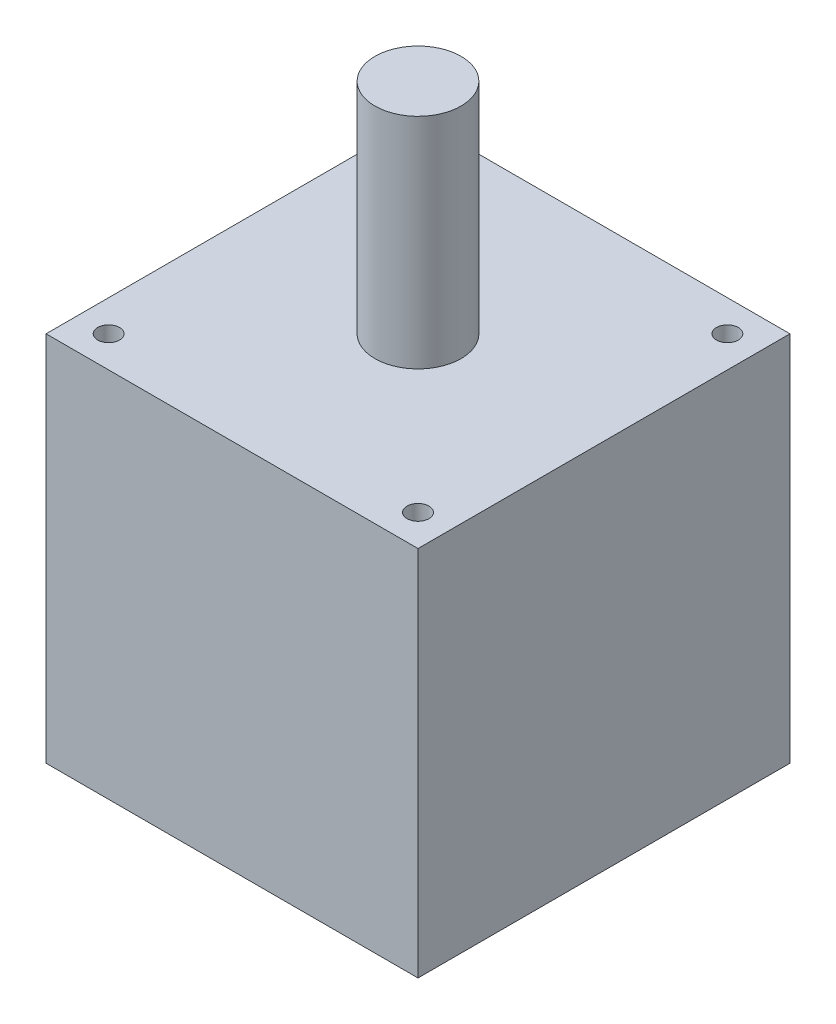
ISO-10303-21;
HEADER;
FILE_DESCRIPTION(('STEP AP214'),'2;1');
FILE_NAME('part.step','',(''),(''),'','','');
FILE_SCHEMA(('AUTOMOTIVE_DESIGN { 1 0 10303 214 1 1 1 1 }'));
ENDSEC;
DATA;
#1=APPLICATION_CONTEXT('core data for automotive mechanical design processes');
#2=APPLICATION_PROTOCOL_DEFINITION('international standard','automotive_design',2000,#1);
#3=PRODUCT_CONTEXT('',#1,'mechanical');
#4=PRODUCT('Part','Part','',(#3));
#5=PRODUCT_RELATED_PRODUCT_CATEGORY('part','',(#4));
#6=PRODUCT_DEFINITION_FORMATION('','',#4);
#7=PRODUCT_DEFINITION_CONTEXT('part definition',#1,'design');
#8=PRODUCT_DEFINITION('design','',#6,#7);
#9=PRODUCT_DEFINITION_SHAPE('','',#8);
#10=(LENGTH_UNIT() NAMED_UNIT(*) SI_UNIT(.MILLI.,.METRE.));
#11=(NAMED_UNIT(*) PLANE_ANGLE_UNIT() SI_UNIT($,.RADIAN.));
#12=(NAMED_UNIT(*) SI_UNIT($,.STERADIAN.) SOLID_ANGLE_UNIT());
#13=UNCERTAINTY_MEASURE_WITH_UNIT(LENGTH_MEASURE(1.E-05),#10,'distance_accuracy_value','');
#14=(GEOMETRIC_REPRESENTATION_CONTEXT(3) GLOBAL_UNCERTAINTY_ASSIGNED_CONTEXT((#13)) GLOBAL_UNIT_ASSIGNED_CONTEXT((#10,
#11,#12)) REPRESENTATION_CONTEXT('',''));
#15=CARTESIAN_POINT('',(0.,0.,0.));
#16=DIRECTION('',(0.,0.,1.));
#17=DIRECTION('',(1.,0.,0.));
#18=AXIS2_PLACEMENT_3D('',#15,#16,#17);
#19=CARTESIAN_POINT('',(17.9550877578617,-3.59210244842767,17.9550877578617));
#20=DIRECTION('',(0.,1.,0.));
#21=DIRECTION('',(0.,0.,1.));
#22=AXIS2_PLACEMENT_3D('',#19,#20,#21);
#23=CYLINDRICAL_SURFACE('',#22,1.27);
#24=CARTESIAN_POINT('',(17.9550877578617,43.18,17.9550877578617));
#25=DIRECTION('',(0.,1.,0.));
#26=DIRECTION('',(0.,0.,1.));
#27=AXIS2_PLACEMENT_3D('',#24,#25,#26);
#28=CIRCLE('',#27,1.27);
#29=CARTESIAN_POINT('',(17.9550877578617,43.18,19.2250877578617));
#30=VERTEX_POINT('',#29);
#31=EDGE_CURVE('E48',#30,#30,#28,.T.);
#32=ORIENTED_EDGE('',*,*,#31,.T.);
#33=EDGE_LOOP('',(#32));
#34=FACE_BOUND('',#33,.T.);
#35=CARTESIAN_POINT('',(17.9550877578617,0.,17.9550877578617));
#36=DIRECTION('',(0.,-1.,0.));
#37=DIRECTION('',(0.,0.,-1.));
#38=AXIS2_PLACEMENT_3D('',#35,#36,#37);
#39=CIRCLE('',#38,1.27);
#40=CARTESIAN_POINT('',(17.9550877578617,0.,16.6850877578617));
#41=VERTEX_POINT('',#40);
#42=EDGE_CURVE('E11',#41,#41,#39,.F.);
#43=ORIENTED_EDGE('',*,*,#42,.F.);
#44=EDGE_LOOP('',(#43));
#45=FACE_BOUND('',#44,.T.);
#46=ADVANCED_FACE('F39',(#34,#45),#23,.F.);
#47=CARTESIAN_POINT('',(-17.9605122421383,-3.59210244842767,17.9550877578617));
#48=DIRECTION('',(0.,1.,0.));
#49=DIRECTION('',(0.,0.,1.));
#50=AXIS2_PLACEMENT_3D('',#47,#48,#49);
#51=CYLINDRICAL_SURFACE('',#50,1.27);
#52=CARTESIAN_POINT('',(-17.9605122421383,43.18,17.9550877578617));
#53=DIRECTION('',(0.,1.,0.));
#54=DIRECTION('',(0.,0.,1.));
#55=AXIS2_PLACEMENT_3D('',#52,#53,#54);
#56=CIRCLE('',#55,1.27);
#57=CARTESIAN_POINT('',(-17.9605122421383,43.18,19.2250877578617));
#58=VERTEX_POINT('',#57);
#59=EDGE_CURVE('E130',#58,#58,#56,.T.);
#60=ORIENTED_EDGE('',*,*,#59,.T.);
#61=EDGE_LOOP('',(#60));
#62=FACE_BOUND('',#61,.T.);
#63=CARTESIAN_POINT('',(-17.9605122421383,0.,17.9550877578617));
#64=DIRECTION('',(0.,-1.,0.));
#65=DIRECTION('',(0.,0.,-1.));
#66=AXIS2_PLACEMENT_3D('',#63,#64,#65);
#67=CIRCLE('',#66,1.27);
#68=CARTESIAN_POINT('',(-17.9605122421383,0.,16.6850877578617));
#69=VERTEX_POINT('',#68);
#70=EDGE_CURVE('E134',#69,#69,#67,.F.);
#71=ORIENTED_EDGE('',*,*,#70,.F.);
#72=EDGE_LOOP('',(#71));
#73=FACE_BOUND('',#72,.T.);
#74=ADVANCED_FACE('F160',(#62,#73),#51,.F.);
#75=CARTESIAN_POINT('',(21.59,43.18,21.59));
#76=DIRECTION('',(-1.,0.,0.));
#77=DIRECTION('',(0.,0.,1.));
#78=AXIS2_PLACEMENT_3D('',#75,#76,#77);
#79=PLANE('',#78);
#80=DIRECTION('',(0.,0.,-1.));
#81=VECTOR('',#80,1.);
#82=CARTESIAN_POINT('',(21.59,0.,21.59));
#83=LINE('',#82,#81);
#84=CARTESIAN_POINT('',(21.59,0.,21.59));
#85=VERTEX_POINT('',#84);
#86=CARTESIAN_POINT('',(21.59,0.,-21.59));
#87=VERTEX_POINT('',#86);
#88=EDGE_CURVE('E112',#85,#87,#83,.T.);
#89=ORIENTED_EDGE('',*,*,#88,.T.);
#90=DIRECTION('',(0.,-1.,0.));
#91=VECTOR('',#90,1.);
#92=CARTESIAN_POINT('',(21.59,43.18,-21.59));
#93=LINE('',#92,#91);
#94=CARTESIAN_POINT('',(21.59,43.18,-21.59));
#95=VERTEX_POINT('',#94);
#96=EDGE_CURVE('E101',#95,#87,#93,.T.);
#97=ORIENTED_EDGE('',*,*,#96,.F.);
#98=DIRECTION('',(0.,0.,-1.));
#99=VECTOR('',#98,1.);
#100=CARTESIAN_POINT('',(21.59,43.18,21.59));
#101=LINE('',#100,#99);
#102=CARTESIAN_POINT('',(21.59,43.18,21.59));
#103=VERTEX_POINT('',#102);
#104=EDGE_CURVE('E93',#103,#95,#101,.T.);
#105=ORIENTED_EDGE('',*,*,#104,.F.);
#106=DIRECTION('',(0.,-1.,0.));
#107=VECTOR('',#106,1.);
#108=CARTESIAN_POINT('',(21.59,43.18,21.59));
#109=LINE('',#108,#107);
#110=EDGE_CURVE('E108',#103,#85,#109,.T.);
#111=ORIENTED_EDGE('',*,*,#110,.T.);
#112=EDGE_LOOP('',(#89,#97,#105,#111));
#113=FACE_BOUND('',#112,.T.);
#114=ADVANCED_FACE('F164',(#113),#79,.F.);
#115=CARTESIAN_POINT('',(-21.59,43.18,-21.59));
#116=DIRECTION('',(0.,0.,1.));
#117=DIRECTION('',(1.,0.,0.));
#118=AXIS2_PLACEMENT_3D('',#115,#116,#117);
#119=PLANE('',#118);
#120=DIRECTION('',(-1.,0.,0.));
#121=VECTOR('',#120,1.);
#122=CARTESIAN_POINT('',(-21.59,0.,-21.59));
#123=LINE('',#122,#121);
#124=CARTESIAN_POINT('',(-21.59,0.,-21.59));
#125=VERTEX_POINT('',#124);
#126=EDGE_CURVE('E99',#87,#125,#123,.T.);
#127=ORIENTED_EDGE('',*,*,#126,.T.);
#128=DIRECTION('',(0.,-1.,0.));
#129=VECTOR('',#128,1.);
#130=CARTESIAN_POINT('',(-21.59,43.18,-21.59));
#131=LINE('',#130,#129);
#132=CARTESIAN_POINT('',(-21.59,43.18,-21.59));
#133=VERTEX_POINT('',#132);
#134=EDGE_CURVE('E97',#133,#125,#131,.T.);
#135=ORIENTED_EDGE('',*,*,#134,.F.);
#136=DIRECTION('',(-1.,0.,0.));
#137=VECTOR('',#136,1.);
#138=CARTESIAN_POINT('',(-21.59,43.18,-21.59));
#139=LINE('',#138,#137);
#140=EDGE_CURVE('E87',#95,#133,#139,.T.);
#141=ORIENTED_EDGE('',*,*,#140,.F.);
#142=ORIENTED_EDGE('',*,*,#96,.T.);
#143=EDGE_LOOP('',(#127,#135,#141,#142));
#144=FACE_BOUND('',#143,.T.);
#145=ADVANCED_FACE('F98',(#144),#119,.F.);
#146=CARTESIAN_POINT('',(-21.59,43.18,21.59));
#147=DIRECTION('',(1.,0.,0.));
#148=DIRECTION('',(0.,0.,-1.));
#149=AXIS2_PLACEMENT_3D('',#146,#147,#148);
#150=PLANE('',#149);
#151=DIRECTION('',(0.,0.,1.));
#152=VECTOR('',#151,1.);
#153=CARTESIAN_POINT('',(-21.59,0.,21.59));
#154=LINE('',#153,#152);
#155=CARTESIAN_POINT('',(-21.59,0.,21.59));
#156=VERTEX_POINT('',#155);
#157=EDGE_CURVE('E73',#125,#156,#154,.T.);
#158=ORIENTED_EDGE('',*,*,#157,.T.);
#159=DIRECTION('',(0.,-1.,0.));
#160=VECTOR('',#159,1.);
#161=CARTESIAN_POINT('',(-21.59,43.18,21.59));
#162=LINE('',#161,#160);
#163=CARTESIAN_POINT('',(-21.59,43.18,21.59));
#164=VERTEX_POINT('',#163);
#165=EDGE_CURVE('E102',#164,#156,#162,.T.);
#166=ORIENTED_EDGE('',*,*,#165,.F.);
#167=DIRECTION('',(0.,0.,1.));
#168=VECTOR('',#167,1.);
#169=CARTESIAN_POINT('',(-21.59,43.18,21.59));
#170=LINE('',#169,#168);
#171=EDGE_CURVE('E91',#133,#164,#170,.T.);
#172=ORIENTED_EDGE('',*,*,#171,.F.);
#173=ORIENTED_EDGE('',*,*,#134,.T.);
#174=EDGE_LOOP('',(#158,#166,#172,#173));
#175=FACE_BOUND('',#174,.T.);
#176=ADVANCED_FACE('F104',(#175),#150,.F.);
#177=CARTESIAN_POINT('',(-21.59,43.18,21.59));
#178=DIRECTION('',(0.,0.,-1.));
#179=DIRECTION('',(-1.,0.,0.));
#180=AXIS2_PLACEMENT_3D('',#177,#178,#179);
#181=PLANE('',#180);
#182=DIRECTION('',(1.,0.,0.));
#183=VECTOR('',#182,1.);
#184=CARTESIAN_POINT('',(-21.59,0.,21.59));
#185=LINE('',#184,#183);
#186=EDGE_CURVE('E79',#156,#85,#185,.T.);
#187=ORIENTED_EDGE('',*,*,#186,.T.);
#188=ORIENTED_EDGE('',*,*,#110,.F.);
#189=DIRECTION('',(1.,0.,0.));
#190=VECTOR('',#189,1.);
#191=CARTESIAN_POINT('',(-21.59,43.18,21.59));
#192=LINE('',#191,#190);
#193=EDGE_CURVE('E56',#164,#103,#192,.T.);
#194=ORIENTED_EDGE('',*,*,#193,.F.);
#195=ORIENTED_EDGE('',*,*,#165,.T.);
#196=EDGE_LOOP('',(#187,#188,#194,#195));
#197=FACE_BOUND('',#196,.T.);
#198=ADVANCED_FACE('F145',(#197),#181,.F.);
#199=CARTESIAN_POINT('',(0.,43.18,0.));
#200=DIRECTION('',(0.,-1.,0.));
#201=DIRECTION('',(0.,0.,-1.));
#202=AXIS2_PLACEMENT_3D('',#199,#200,#201);
#203=PLANE('',#202);
#204=CARTESIAN_POINT('',(17.9550877578617,43.18,-17.9605122421383));
#205=DIRECTION('',(0.,1.,0.));
#206=DIRECTION('',(0.,0.,1.));
#207=AXIS2_PLACEMENT_3D('',#204,#205,#206);
#208=CIRCLE('',#207,1.27);
#209=CARTESIAN_POINT('',(17.9550877578617,43.18,-16.6905122421383));
#210=VERTEX_POINT('',#209);
#211=EDGE_CURVE('E246',#210,#210,#208,.T.);
#212=ORIENTED_EDGE('',*,*,#211,.F.);
#213=EDGE_LOOP('',(#212));
#214=FACE_BOUND('',#213,.T.);
#215=CARTESIAN_POINT('',(-17.9605122421383,43.18,-17.9605122421383));
#216=DIRECTION('',(0.,1.,0.));
#217=DIRECTION('',(0.,0.,1.));
#218=AXIS2_PLACEMENT_3D('',#215,#216,#217);
#219=CIRCLE('',#218,1.27);
#220=CARTESIAN_POINT('',(-17.9605122421383,43.18,-16.6905122421383));
#221=VERTEX_POINT('',#220);
#222=EDGE_CURVE('E251',#221,#221,#219,.T.);
#223=ORIENTED_EDGE('',*,*,#222,.F.);
#224=EDGE_LOOP('',(#223));
#225=FACE_BOUND('',#224,.T.);
#226=CARTESIAN_POINT('',(0.,43.18,0.));
#227=DIRECTION('',(0.,1.,0.));
#228=DIRECTION('',(0.,0.,1.));
#229=AXIS2_PLACEMENT_3D('',#226,#227,#228);
#230=CIRCLE('',#229,4.99999999998);
#231=CARTESIAN_POINT('',(0.,43.18,4.99999999998));
#232=VERTEX_POINT('',#231);
#233=EDGE_CURVE('E129',#232,#232,#230,.T.);
#234=ORIENTED_EDGE('',*,*,#233,.F.);
#235=EDGE_LOOP('',(#234));
#236=FACE_BOUND('',#235,.T.);
#237=ORIENTED_EDGE('',*,*,#104,.T.);
#238=ORIENTED_EDGE('',*,*,#140,.T.);
#239=ORIENTED_EDGE('',*,*,#171,.T.);
#240=ORIENTED_EDGE('',*,*,#193,.T.);
#241=EDGE_LOOP('',(#237,#238,#239,#240));
#242=FACE_BOUND('',#241,.T.);
#243=ORIENTED_EDGE('',*,*,#59,.F.);
#244=EDGE_LOOP('',(#243));
#245=FACE_BOUND('',#244,.T.);
#246=ORIENTED_EDGE('',*,*,#31,.F.);
#247=EDGE_LOOP('',(#246));
#248=FACE_BOUND('',#247,.T.);
#249=ADVANCED_FACE('F88',(#214,#225,#236,#242,#245,#248),#203,.F.);
#250=CARTESIAN_POINT('',(0.,0.,0.));
#251=DIRECTION('',(0.,-1.,0.));
#252=DIRECTION('',(0.,0.,-1.));
#253=AXIS2_PLACEMENT_3D('',#250,#251,#252);
#254=PLANE('',#253);
#255=CARTESIAN_POINT('',(17.9550877578617,0.,-17.9605122421383));
#256=DIRECTION('',(0.,-1.,0.));
#257=DIRECTION('',(0.,0.,-1.));
#258=AXIS2_PLACEMENT_3D('',#255,#256,#257);
#259=CIRCLE('',#258,1.27);
#260=CARTESIAN_POINT('',(17.9550877578617,0.,-19.2305122421383));
#261=VERTEX_POINT('',#260);
#262=EDGE_CURVE('E249',#261,#261,#259,.F.);
#263=ORIENTED_EDGE('',*,*,#262,.T.);
#264=EDGE_LOOP('',(#263));
#265=FACE_BOUND('',#264,.T.);
#266=CARTESIAN_POINT('',(-17.9605122421383,0.,-17.9605122421383));
#267=DIRECTION('',(0.,-1.,0.));
#268=DIRECTION('',(0.,0.,-1.));
#269=AXIS2_PLACEMENT_3D('',#266,#267,#268);
#270=CIRCLE('',#269,1.27);
#271=CARTESIAN_POINT('',(-17.9605122421383,0.,-19.2305122421383));
#272=VERTEX_POINT('',#271);
#273=EDGE_CURVE('E256',#272,#272,#270,.F.);
#274=ORIENTED_EDGE('',*,*,#273,.T.);
#275=EDGE_LOOP('',(#274));
#276=FACE_BOUND('',#275,.T.);
#277=ORIENTED_EDGE('',*,*,#88,.F.);
#278=ORIENTED_EDGE('',*,*,#186,.F.);
#279=ORIENTED_EDGE('',*,*,#157,.F.);
#280=ORIENTED_EDGE('',*,*,#126,.F.);
#281=EDGE_LOOP('',(#277,#278,#279,#280));
#282=FACE_BOUND('',#281,.T.);
#283=ORIENTED_EDGE('',*,*,#70,.T.);
#284=EDGE_LOOP('',(#283));
#285=FACE_BOUND('',#284,.T.);
#286=ORIENTED_EDGE('',*,*,#42,.T.);
#287=EDGE_LOOP('',(#286));
#288=FACE_BOUND('',#287,.T.);
#289=ADVANCED_FACE('F144',(#265,#276,#282,#285,#288),#254,.T.);
#290=CARTESIAN_POINT('',(0.,68.58,0.));
#291=DIRECTION('',(0.,-1.,0.));
#292=DIRECTION('',(0.,0.,-1.));
#293=AXIS2_PLACEMENT_3D('',#290,#291,#292);
#294=CYLINDRICAL_SURFACE('',#293,4.99999999998);
#295=CARTESIAN_POINT('',(0.,68.58,0.));
#296=DIRECTION('',(0.,1.,0.));
#297=DIRECTION('',(0.,0.,1.));
#298=AXIS2_PLACEMENT_3D('',#295,#296,#297);
#299=CIRCLE('',#298,4.99999999998);
#300=CARTESIAN_POINT('',(0.,68.58,4.99999999998));
#301=VERTEX_POINT('',#300);
#302=EDGE_CURVE('E116',#301,#301,#299,.T.);
#303=ORIENTED_EDGE('',*,*,#302,.F.);
#304=EDGE_LOOP('',(#303));
#305=FACE_BOUND('',#304,.T.);
#306=ORIENTED_EDGE('',*,*,#233,.T.);
#307=EDGE_LOOP('',(#306));
#308=FACE_BOUND('',#307,.T.);
#309=ADVANCED_FACE('F152',(#305,#308),#294,.T.);
#310=CARTESIAN_POINT('',(0.,68.58,0.));
#311=DIRECTION('',(0.,1.,0.));
#312=DIRECTION('',(0.,0.,1.));
#313=AXIS2_PLACEMENT_3D('',#310,#311,#312);
#314=PLANE('',#313);
#315=ORIENTED_EDGE('',*,*,#302,.T.);
#316=EDGE_LOOP('',(#315));
#317=FACE_BOUND('',#316,.T.);
#318=ADVANCED_FACE('F194',(#317),#314,.T.);
#319=CARTESIAN_POINT('',(-17.9605122421383,-3.59210244842767,-17.9605122421383));
#320=DIRECTION('',(0.,1.,0.));
#321=DIRECTION('',(0.,0.,1.));
#322=AXIS2_PLACEMENT_3D('',#319,#320,#321);
#323=CYLINDRICAL_SURFACE('',#322,1.27);
#324=ORIENTED_EDGE('',*,*,#222,.T.);
#325=EDGE_LOOP('',(#324));
#326=FACE_BOUND('',#325,.T.);
#327=ORIENTED_EDGE('',*,*,#273,.F.);
#328=EDGE_LOOP('',(#327));
#329=FACE_BOUND('',#328,.T.);
#330=ADVANCED_FACE('F204',(#326,#329),#323,.F.);
#331=CARTESIAN_POINT('',(17.9550877578617,-3.59210244842767,-17.9605122421383));
#332=DIRECTION('',(0.,1.,0.));
#333=DIRECTION('',(0.,0.,1.));
#334=AXIS2_PLACEMENT_3D('',#331,#332,#333);
#335=CYLINDRICAL_SURFACE('',#334,1.27);
#336=ORIENTED_EDGE('',*,*,#211,.T.);
#337=EDGE_LOOP('',(#336));
#338=FACE_BOUND('',#337,.T.);
#339=ORIENTED_EDGE('',*,*,#262,.F.);
#340=EDGE_LOOP('',(#339));
#341=FACE_BOUND('',#340,.T.);
#342=ADVANCED_FACE('F213',(#338,#341),#335,.F.);
#343=CLOSED_SHELL('',(#46,#74,#114,#145,#176,#198,#249,#289,#309,#318,#330,#342));
#344=MANIFOLD_SOLID_BREP('B2',#343);
#345=ADVANCED_BREP_SHAPE_REPRESENTATION('',(#18,#344),#14);
#346=SHAPE_DEFINITION_REPRESENTATION(#9,#345);
ENDSEC;
END-ISO-10303-21;
